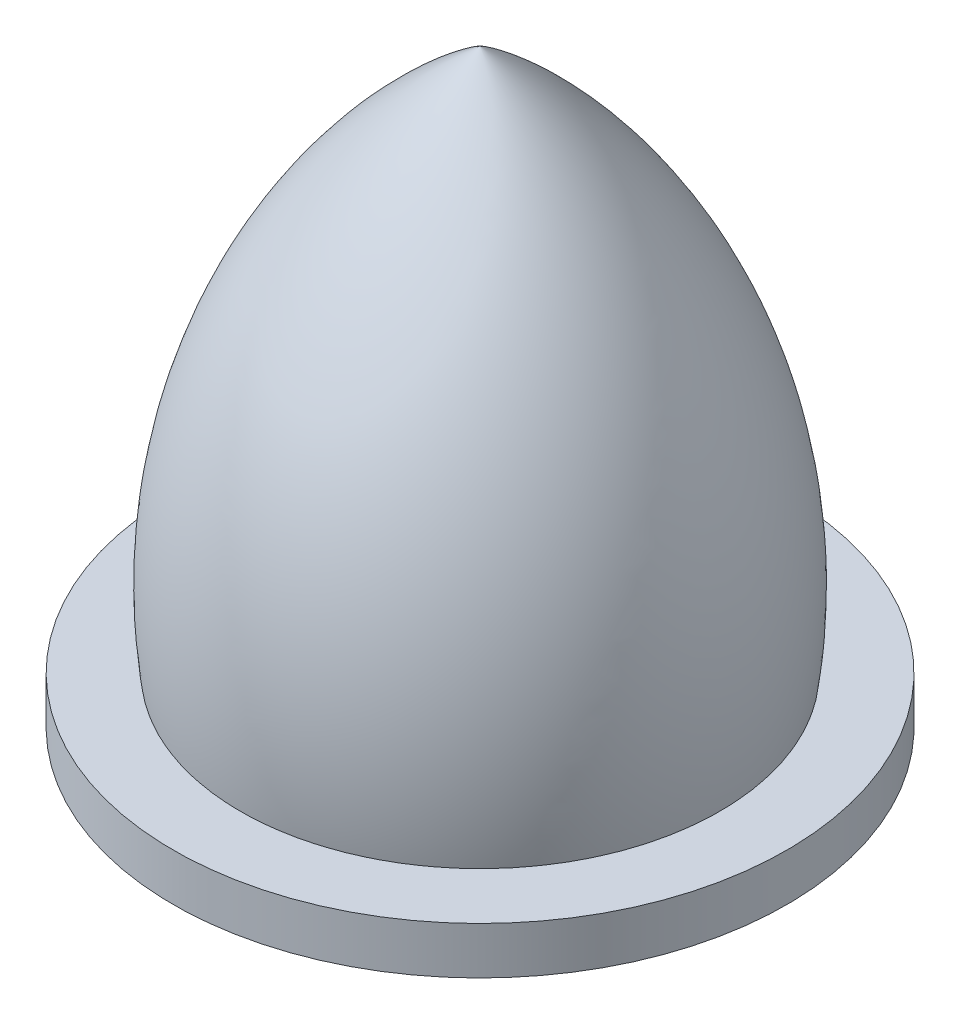
ISO-10303-21;
HEADER;
FILE_DESCRIPTION(('STEP AP214'),'2;1');
FILE_NAME('part.step','',(''),(''),'','','');
FILE_SCHEMA(('AUTOMOTIVE_DESIGN { 1 0 10303 214 1 1 1 1 }'));
ENDSEC;
DATA;
#1=APPLICATION_CONTEXT('core data for automotive mechanical design processes');
#2=APPLICATION_PROTOCOL_DEFINITION('international standard','automotive_design',2000,#1);
#3=PRODUCT_CONTEXT('',#1,'mechanical');
#4=PRODUCT('Part','Part','',(#3));
#5=PRODUCT_RELATED_PRODUCT_CATEGORY('part','',(#4));
#6=PRODUCT_DEFINITION_FORMATION('','',#4);
#7=PRODUCT_DEFINITION_CONTEXT('part definition',#1,'design');
#8=PRODUCT_DEFINITION('design','',#6,#7);
#9=PRODUCT_DEFINITION_SHAPE('','',#8);
#10=(LENGTH_UNIT() NAMED_UNIT(*) SI_UNIT(.MILLI.,.METRE.));
#11=(NAMED_UNIT(*) PLANE_ANGLE_UNIT() SI_UNIT($,.RADIAN.));
#12=(NAMED_UNIT(*) SI_UNIT($,.STERADIAN.) SOLID_ANGLE_UNIT());
#13=UNCERTAINTY_MEASURE_WITH_UNIT(LENGTH_MEASURE(1.E-05),#10,'distance_accuracy_value','');
#14=(GEOMETRIC_REPRESENTATION_CONTEXT(3) GLOBAL_UNCERTAINTY_ASSIGNED_CONTEXT((#13)) GLOBAL_UNIT_ASSIGNED_CONTEXT((#10,
#11,#12)) REPRESENTATION_CONTEXT('',''));
#15=CARTESIAN_POINT('',(0.,0.,0.));
#16=DIRECTION('',(0.,0.,1.));
#17=DIRECTION('',(1.,0.,0.));
#18=AXIS2_PLACEMENT_3D('',#15,#16,#17);
#19=CARTESIAN_POINT('',(0.,-0.5,0.));
#20=DIRECTION('',(0.,-1.,0.));
#21=DIRECTION('',(0.,0.,-1.));
#22=AXIS2_PLACEMENT_3D('',#19,#20,#21);
#23=PLANE('',#22);
#24=CARTESIAN_POINT('',(0.,-0.5,0.));
#25=DIRECTION('',(0.,-1.,0.));
#26=DIRECTION('',(0.,0.,-1.));
#27=AXIS2_PLACEMENT_3D('',#24,#25,#26);
#28=CIRCLE('',#27,6.5);
#29=CARTESIAN_POINT('',(0.,-0.5,-6.5));
#30=VERTEX_POINT('',#29);
#31=EDGE_CURVE('E11',#30,#30,#28,.T.);
#32=ORIENTED_EDGE('',*,*,#31,.T.);
#33=EDGE_LOOP('',(#32));
#34=FACE_BOUND('',#33,.T.);
#35=CARTESIAN_POINT('',(0.,-0.5,0.));
#36=DIRECTION('',(0.,-1.,0.));
#37=DIRECTION('',(0.,0.,-1.));
#38=AXIS2_PLACEMENT_3D('',#35,#36,#37);
#39=CIRCLE('',#38,5.);
#40=CARTESIAN_POINT('',(0.,-0.5,-5.));
#41=VERTEX_POINT('',#40);
#42=EDGE_CURVE('E58',#41,#41,#39,.T.);
#43=ORIENTED_EDGE('',*,*,#42,.F.);
#44=EDGE_LOOP('',(#43));
#45=FACE_BOUND('',#44,.T.);
#46=ADVANCED_FACE('F47',(#34,#45),#23,.T.);
#47=CARTESIAN_POINT('',(0.,0.5,0.));
#48=DIRECTION('',(0.,-1.,0.));
#49=DIRECTION('',(0.,0.,-1.));
#50=AXIS2_PLACEMENT_3D('',#47,#48,#49);
#51=PLANE('',#50);
#52=CARTESIAN_POINT('',(0.,0.5,0.));
#53=DIRECTION('',(0.,-1.,0.));
#54=DIRECTION('',(0.,0.,-1.));
#55=AXIS2_PLACEMENT_3D('',#52,#53,#54);
#56=CIRCLE('',#55,6.5);
#57=CARTESIAN_POINT('',(0.,0.5,-6.5));
#58=VERTEX_POINT('',#57);
#59=EDGE_CURVE('E51',#58,#58,#56,.T.);
#60=ORIENTED_EDGE('',*,*,#59,.F.);
#61=EDGE_LOOP('',(#60));
#62=FACE_BOUND('',#61,.T.);
#63=CARTESIAN_POINT('',(0.,0.5,0.));
#64=DIRECTION('',(0.,-1.,0.));
#65=DIRECTION('',(0.,0.,-1.));
#66=AXIS2_PLACEMENT_3D('',#63,#64,#65);
#67=CIRCLE('',#66,5.);
#68=CARTESIAN_POINT('',(0.,0.5,-5.));
#69=VERTEX_POINT('',#68);
#70=EDGE_CURVE('E60',#69,#69,#67,.T.);
#71=ORIENTED_EDGE('',*,*,#70,.T.);
#72=EDGE_LOOP('',(#71));
#73=FACE_BOUND('',#72,.T.);
#74=ADVANCED_FACE('F70',(#62,#73),#51,.F.);
#75=CARTESIAN_POINT('',(0.,-0.5,0.));
#76=DIRECTION('',(0.,1.,0.));
#77=DIRECTION('',(0.,0.,1.));
#78=AXIS2_PLACEMENT_3D('',#75,#76,#77);
#79=CYLINDRICAL_SURFACE('',#78,6.5);
#80=ORIENTED_EDGE('',*,*,#31,.F.);
#81=EDGE_LOOP('',(#80));
#82=FACE_BOUND('',#81,.T.);
#83=ORIENTED_EDGE('',*,*,#59,.T.);
#84=EDGE_LOOP('',(#83));
#85=FACE_BOUND('',#84,.T.);
#86=ADVANCED_FACE('F49',(#82,#85),#79,.T.);
#87=CARTESIAN_POINT('',(0.,-0.5,0.));
#88=DIRECTION('',(0.,1.,0.));
#89=DIRECTION('',(0.,0.,1.));
#90=AXIS2_PLACEMENT_3D('',#87,#88,#89);
#91=CYLINDRICAL_SURFACE('',#90,5.);
#92=ORIENTED_EDGE('',*,*,#42,.T.);
#93=EDGE_LOOP('',(#92));
#94=FACE_BOUND('',#93,.T.);
#95=ORIENTED_EDGE('',*,*,#70,.F.);
#96=EDGE_LOOP('',(#95));
#97=FACE_BOUND('',#96,.T.);
#98=ADVANCED_FACE('F66',(#94,#97),#91,.F.);
#99=CLOSED_SHELL('',(#46,#74,#86,#98));
#100=MANIFOLD_SOLID_BREP('B2',#99);
#101=CARTESIAN_POINT('',(0.,0.,0.));
#102=DIRECTION('',(0.,1.,0.));
#103=DIRECTION('',(0.,0.,1.));
#104=AXIS2_PLACEMENT_3D('',#101,#102,#103);
#105=PLANE('',#104);
#106=CARTESIAN_POINT('',(0.,0.,0.));
#107=DIRECTION('',(0.,-1.,0.));
#108=DIRECTION('',(0.,0.,-1.));
#109=AXIS2_PLACEMENT_3D('',#106,#107,#108);
#110=CIRCLE('',#109,1.55);
#111=CARTESIAN_POINT('',(0.,0.,-1.55));
#112=VERTEX_POINT('',#111);
#113=EDGE_CURVE('E140',#112,#112,#110,.T.);
#114=ORIENTED_EDGE('',*,*,#113,.F.);
#115=EDGE_LOOP('',(#114));
#116=FACE_BOUND('',#115,.T.);
#117=CARTESIAN_POINT('',(0.,0.,0.));
#118=DIRECTION('',(0.,-1.,0.));
#119=DIRECTION('',(0.,0.,-1.));
#120=AXIS2_PLACEMENT_3D('',#117,#118,#119);
#121=CIRCLE('',#120,5.);
#122=CARTESIAN_POINT('',(0.,0.,-5.));
#123=VERTEX_POINT('',#122);
#124=EDGE_CURVE('E45',#123,#123,#121,.T.);
#125=ORIENTED_EDGE('',*,*,#124,.T.);
#126=EDGE_LOOP('',(#125));
#127=FACE_BOUND('',#126,.T.);
#128=ADVANCED_FACE('F109',(#116,#127),#105,.F.);
#129=CARTESIAN_POINT('',(0.,2.12033826887846,6.8111881546917));
#130=DIRECTION('',(-1.,0.,0.));
#131=DIRECTION('',(0.,0.,-1.));
#132=AXIS2_PLACEMENT_3D('',#129,#130,#131);
#133=CIRCLE('',#132,12.);
#134=TRIMMED_CURVE('',#133,(PARAMETER_VALUE(-0.967209691792582)),
(PARAMETER_VALUE(0.967209691792582)),.T.,.PARAMETER.);
#135=CARTESIAN_POINT('',(0.,2.12033826887846,0.));
#136=DIRECTION('',(0.,-1.,0.));
#137=AXIS1_PLACEMENT('',#135,#136);
#138=SURFACE_OF_REVOLUTION('',#134,#137);
#139=ORIENTED_EDGE('',*,*,#124,.F.);
#140=EDGE_LOOP('',(#139));
#141=FACE_BOUND('',#140,.T.);
#142=CARTESIAN_POINT('',(0.,12.,0.));
#143=VERTEX_POINT('',#142);
#144=VERTEX_LOOP('',#143);
#145=FACE_BOUND('',#144,.T.);
#146=ADVANCED_FACE('F119',(#141,#145),#138,.T.);
#147=CARTESIAN_POINT('',(0.,4.,0.));
#148=DIRECTION('',(0.,-1.,0.));
#149=DIRECTION('',(0.,0.,-1.));
#150=AXIS2_PLACEMENT_3D('',#147,#148,#149);
#151=CYLINDRICAL_SURFACE('',#150,1.55);
#152=CARTESIAN_POINT('',(0.,4.,0.));
#153=DIRECTION('',(0.,-1.,0.));
#154=DIRECTION('',(0.,0.,-1.));
#155=AXIS2_PLACEMENT_3D('',#152,#153,#154);
#156=CIRCLE('',#155,1.55);
#157=CARTESIAN_POINT('',(0.,4.,-1.55));
#158=VERTEX_POINT('',#157);
#159=EDGE_CURVE('E116',#158,#158,#156,.T.);
#160=ORIENTED_EDGE('',*,*,#159,.F.);
#161=EDGE_LOOP('',(#160));
#162=FACE_BOUND('',#161,.T.);
#163=ORIENTED_EDGE('',*,*,#113,.T.);
#164=EDGE_LOOP('',(#163));
#165=FACE_BOUND('',#164,.T.);
#166=ADVANCED_FACE('F121',(#162,#165),#151,.F.);
#167=CARTESIAN_POINT('',(0.,4.,0.));
#168=DIRECTION('',(0.,-1.,0.));
#169=DIRECTION('',(0.,0.,-1.));
#170=AXIS2_PLACEMENT_3D('',#167,#168,#169);
#171=PLANE('',#170);
#172=ORIENTED_EDGE('',*,*,#159,.T.);
#173=EDGE_LOOP('',(#172));
#174=FACE_BOUND('',#173,.T.);
#175=ADVANCED_FACE('F127',(#174),#171,.T.);
#176=CLOSED_SHELL('',(#128,#146,#166,#175));
#177=MANIFOLD_SOLID_BREP('B6',#176);
#178=ADVANCED_BREP_SHAPE_REPRESENTATION('',(#18,#100,#177),#14);
#179=SHAPE_DEFINITION_REPRESENTATION(#9,#178);
ENDSEC;
END-ISO-10303-21;
